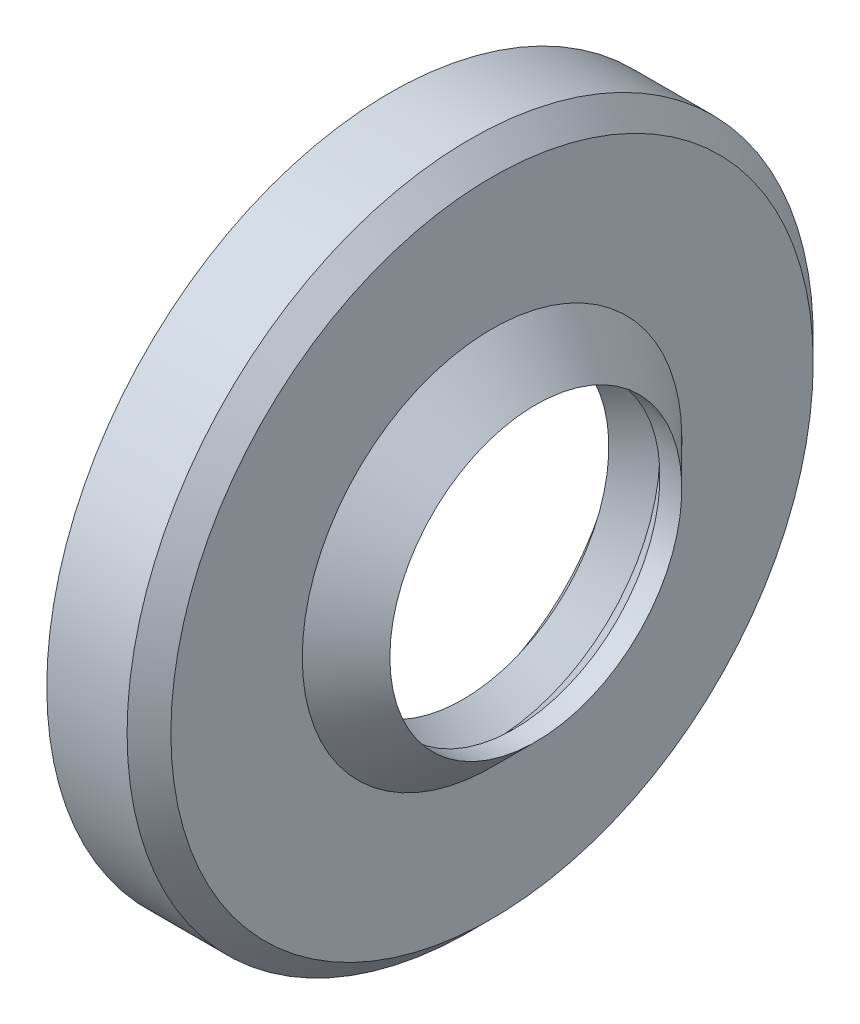
ISO-10303-21;
HEADER;
FILE_DESCRIPTION(('STEP AP214'),'2;1');
FILE_NAME('part.step','',(''),(''),'','','');
FILE_SCHEMA(('AUTOMOTIVE_DESIGN { 1 0 10303 214 1 1 1 1 }'));
ENDSEC;
DATA;
#1=APPLICATION_CONTEXT('core data for automotive mechanical design processes');
#2=APPLICATION_PROTOCOL_DEFINITION('international standard','automotive_design',2000,#1);
#3=PRODUCT_CONTEXT('',#1,'mechanical');
#4=PRODUCT('Part','Part','',(#3));
#5=PRODUCT_RELATED_PRODUCT_CATEGORY('part','',(#4));
#6=PRODUCT_DEFINITION_FORMATION('','',#4);
#7=PRODUCT_DEFINITION_CONTEXT('part definition',#1,'design');
#8=PRODUCT_DEFINITION('design','',#6,#7);
#9=PRODUCT_DEFINITION_SHAPE('','',#8);
#10=(LENGTH_UNIT() NAMED_UNIT(*) SI_UNIT(.MILLI.,.METRE.));
#11=(NAMED_UNIT(*) PLANE_ANGLE_UNIT() SI_UNIT($,.RADIAN.));
#12=(NAMED_UNIT(*) SI_UNIT($,.STERADIAN.) SOLID_ANGLE_UNIT());
#13=UNCERTAINTY_MEASURE_WITH_UNIT(LENGTH_MEASURE(1.E-05),#10,'distance_accuracy_value','');
#14=(GEOMETRIC_REPRESENTATION_CONTEXT(3) GLOBAL_UNCERTAINTY_ASSIGNED_CONTEXT((#13)) GLOBAL_UNIT_ASSIGNED_CONTEXT((#10,
#11,#12)) REPRESENTATION_CONTEXT('',''));
#15=CARTESIAN_POINT('',(0.,0.,0.));
#16=DIRECTION('',(0.,0.,1.));
#17=DIRECTION('',(1.,0.,0.));
#18=AXIS2_PLACEMENT_3D('',#15,#16,#17);
#19=CARTESIAN_POINT('',(-1000.,0.,0.));
#20=DIRECTION('',(-1.,0.,0.));
#21=DIRECTION('',(0.,0.,1.));
#22=AXIS2_PLACEMENT_3D('',#19,#20,#21);
#23=CYLINDRICAL_SURFACE('',#22,22.);
#24=CARTESIAN_POINT('',(5.50000000000006,0.,0.));
#25=DIRECTION('',(-1.,0.,0.));
#26=DIRECTION('',(0.,0.,1.));
#27=AXIS2_PLACEMENT_3D('',#24,#25,#26);
#28=CIRCLE('',#27,22.);
#29=CARTESIAN_POINT('',(5.50000000000006,0.,22.));
#30=VERTEX_POINT('',#29);
#31=EDGE_CURVE('E77',#30,#30,#28,.T.);
#32=ORIENTED_EDGE('',*,*,#31,.F.);
#33=EDGE_LOOP('',(#32));
#34=FACE_BOUND('',#33,.T.);
#35=CARTESIAN_POINT('',(0.,0.,0.));
#36=DIRECTION('',(-1.,0.,0.));
#37=DIRECTION('',(0.,0.,1.));
#38=AXIS2_PLACEMENT_3D('',#35,#36,#37);
#39=CIRCLE('',#38,22.);
#40=CARTESIAN_POINT('',(0.,0.,22.));
#41=VERTEX_POINT('',#40);
#42=EDGE_CURVE('E10',#41,#41,#39,.T.);
#43=ORIENTED_EDGE('',*,*,#42,.T.);
#44=EDGE_LOOP('',(#43));
#45=FACE_BOUND('',#44,.T.);
#46=ADVANCED_FACE('F34',(#34,#45),#23,.F.);
#47=CARTESIAN_POINT('',(0.,22.,0.));
#48=DIRECTION('',(1.,0.,0.));
#49=DIRECTION('',(0.,0.,-1.));
#50=AXIS2_PLACEMENT_3D('',#47,#48,#49);
#51=PLANE('',#50);
#52=ORIENTED_EDGE('',*,*,#42,.F.);
#53=EDGE_LOOP('',(#52));
#54=FACE_BOUND('',#53,.T.);
#55=CARTESIAN_POINT('',(0.,0.,0.));
#56=DIRECTION('',(-1.,0.,0.));
#57=DIRECTION('',(0.,0.,1.));
#58=AXIS2_PLACEMENT_3D('',#55,#56,#57);
#59=CIRCLE('',#58,23.5);
#60=CARTESIAN_POINT('',(0.,0.,23.5));
#61=VERTEX_POINT('',#60);
#62=EDGE_CURVE('E40',#61,#61,#59,.T.);
#63=ORIENTED_EDGE('',*,*,#62,.T.);
#64=EDGE_LOOP('',(#63));
#65=FACE_BOUND('',#64,.T.);
#66=ADVANCED_FACE('F84',(#54,#65),#51,.F.);
#67=CARTESIAN_POINT('',(-1000.,0.,0.));
#68=DIRECTION('',(-1.,0.,0.));
#69=DIRECTION('',(0.,0.,1.));
#70=AXIS2_PLACEMENT_3D('',#67,#68,#69);
#71=CYLINDRICAL_SURFACE('',#70,23.5);
#72=ORIENTED_EDGE('',*,*,#62,.F.);
#73=EDGE_LOOP('',(#72));
#74=FACE_BOUND('',#73,.T.);
#75=CARTESIAN_POINT('',(5.50000000000006,0.,0.));
#76=DIRECTION('',(-1.,0.,0.));
#77=DIRECTION('',(0.,0.,1.));
#78=AXIS2_PLACEMENT_3D('',#75,#76,#77);
#79=CIRCLE('',#78,23.5);
#80=CARTESIAN_POINT('',(5.50000000000006,0.,23.5));
#81=VERTEX_POINT('',#80);
#82=EDGE_CURVE('E44',#81,#81,#79,.T.);
#83=ORIENTED_EDGE('',*,*,#82,.T.);
#84=EDGE_LOOP('',(#83));
#85=FACE_BOUND('',#84,.T.);
#86=ADVANCED_FACE('F88',(#74,#85),#71,.T.);
#87=CARTESIAN_POINT('',(6.9999999999999,0.,0.));
#88=DIRECTION('',(-1.,0.,0.));
#89=DIRECTION('',(0.,0.,1.));
#90=AXIS2_PLACEMENT_3D('',#87,#88,#89);
#91=CONICAL_SURFACE('',#90,22.,0.785398163397503);
#92=ORIENTED_EDGE('',*,*,#82,.F.);
#93=EDGE_LOOP('',(#92));
#94=FACE_BOUND('',#93,.T.);
#95=CARTESIAN_POINT('',(6.9999999999999,0.,0.));
#96=DIRECTION('',(-1.,0.,0.));
#97=DIRECTION('',(0.,0.,1.));
#98=AXIS2_PLACEMENT_3D('',#95,#96,#97);
#99=CIRCLE('',#98,22.);
#100=CARTESIAN_POINT('',(6.9999999999999,0.,22.));
#101=VERTEX_POINT('',#100);
#102=EDGE_CURVE('E48',#101,#101,#99,.T.);
#103=ORIENTED_EDGE('',*,*,#102,.T.);
#104=EDGE_LOOP('',(#103));
#105=FACE_BOUND('',#104,.T.);
#106=ADVANCED_FACE('F93',(#94,#105),#91,.T.);
#107=CARTESIAN_POINT('',(7.,22.,0.));
#108=DIRECTION('',(-1.,0.,0.));
#109=DIRECTION('',(0.,0.,1.));
#110=AXIS2_PLACEMENT_3D('',#107,#108,#109);
#111=PLANE('',#110);
#112=ORIENTED_EDGE('',*,*,#102,.F.);
#113=EDGE_LOOP('',(#112));
#114=FACE_BOUND('',#113,.T.);
#115=CARTESIAN_POINT('',(6.9999999999999,0.,0.));
#116=DIRECTION('',(-1.,0.,0.));
#117=DIRECTION('',(0.,0.,1.));
#118=AXIS2_PLACEMENT_3D('',#115,#116,#117);
#119=CIRCLE('',#118,13.);
#120=CARTESIAN_POINT('',(6.9999999999999,0.,13.));
#121=VERTEX_POINT('',#120);
#122=EDGE_CURVE('E53',#121,#121,#119,.T.);
#123=ORIENTED_EDGE('',*,*,#122,.T.);
#124=EDGE_LOOP('',(#123));
#125=FACE_BOUND('',#124,.T.);
#126=ADVANCED_FACE('F99',(#114,#125),#111,.F.);
#127=CARTESIAN_POINT('',(10.,0.,0.));
#128=DIRECTION('',(-1.,0.,0.));
#129=DIRECTION('',(0.,0.,1.));
#130=AXIS2_PLACEMENT_3D('',#127,#128,#129);
#131=CONICAL_SURFACE('',#130,10.,0.785398163397428);
#132=ORIENTED_EDGE('',*,*,#122,.F.);
#133=EDGE_LOOP('',(#132));
#134=FACE_BOUND('',#133,.T.);
#135=CARTESIAN_POINT('',(10.,0.,0.));
#136=DIRECTION('',(-1.,0.,0.));
#137=DIRECTION('',(0.,0.,1.));
#138=AXIS2_PLACEMENT_3D('',#135,#136,#137);
#139=CIRCLE('',#138,10.);
#140=CARTESIAN_POINT('',(10.,0.,10.));
#141=VERTEX_POINT('',#140);
#142=EDGE_CURVE('E56',#141,#141,#139,.T.);
#143=ORIENTED_EDGE('',*,*,#142,.T.);
#144=EDGE_LOOP('',(#143));
#145=FACE_BOUND('',#144,.T.);
#146=ADVANCED_FACE('F103',(#134,#145),#131,.T.);
#147=CARTESIAN_POINT('',(-1000.,0.,0.));
#148=DIRECTION('',(-1.,0.,0.));
#149=DIRECTION('',(0.,0.,1.));
#150=AXIS2_PLACEMENT_3D('',#147,#148,#149);
#151=CYLINDRICAL_SURFACE('',#150,10.);
#152=ORIENTED_EDGE('',*,*,#142,.F.);
#153=EDGE_LOOP('',(#152));
#154=FACE_BOUND('',#153,.T.);
#155=CARTESIAN_POINT('',(8.49999999999995,0.,0.));
#156=DIRECTION('',(-1.,0.,0.));
#157=DIRECTION('',(0.,0.,1.));
#158=AXIS2_PLACEMENT_3D('',#155,#156,#157);
#159=CIRCLE('',#158,10.);
#160=CARTESIAN_POINT('',(8.49999999999995,0.,10.));
#161=VERTEX_POINT('',#160);
#162=EDGE_CURVE('E59',#161,#161,#159,.T.);
#163=ORIENTED_EDGE('',*,*,#162,.T.);
#164=EDGE_LOOP('',(#163));
#165=FACE_BOUND('',#164,.T.);
#166=ADVANCED_FACE('F107',(#154,#165),#151,.F.);
#167=CARTESIAN_POINT('',(6.9999999999999,0.,0.));
#168=DIRECTION('',(-1.,0.,0.));
#169=DIRECTION('',(0.,0.,1.));
#170=AXIS2_PLACEMENT_3D('',#167,#168,#169);
#171=CONICAL_SURFACE('',#170,11.5,0.785398163397427);
#172=ORIENTED_EDGE('',*,*,#162,.F.);
#173=EDGE_LOOP('',(#172));
#174=FACE_BOUND('',#173,.T.);
#175=CARTESIAN_POINT('',(6.9999999999999,0.,0.));
#176=DIRECTION('',(-1.,0.,0.));
#177=DIRECTION('',(0.,0.,1.));
#178=AXIS2_PLACEMENT_3D('',#175,#176,#177);
#179=CIRCLE('',#178,11.5);
#180=CARTESIAN_POINT('',(6.9999999999999,0.,11.5));
#181=VERTEX_POINT('',#180);
#182=EDGE_CURVE('E62',#181,#181,#179,.T.);
#183=ORIENTED_EDGE('',*,*,#182,.T.);
#184=EDGE_LOOP('',(#183));
#185=FACE_BOUND('',#184,.T.);
#186=ADVANCED_FACE('F111',(#174,#185),#171,.F.);
#187=CARTESIAN_POINT('',(5.00000000000012,0.,0.));
#188=DIRECTION('',(1.,0.,0.));
#189=DIRECTION('',(0.,0.,-1.));
#190=AXIS2_PLACEMENT_3D('',#187,#188,#189);
#191=CONICAL_SURFACE('',#190,10.,0.643501108793335);
#192=ORIENTED_EDGE('',*,*,#182,.F.);
#193=EDGE_LOOP('',(#192));
#194=FACE_BOUND('',#193,.T.);
#195=CARTESIAN_POINT('',(5.00000000000012,0.,0.));
#196=DIRECTION('',(-1.,0.,0.));
#197=DIRECTION('',(0.,0.,1.));
#198=AXIS2_PLACEMENT_3D('',#195,#196,#197);
#199=CIRCLE('',#198,10.);
#200=CARTESIAN_POINT('',(5.00000000000012,0.,10.));
#201=VERTEX_POINT('',#200);
#202=EDGE_CURVE('E65',#201,#201,#199,.T.);
#203=ORIENTED_EDGE('',*,*,#202,.T.);
#204=EDGE_LOOP('',(#203));
#205=FACE_BOUND('',#204,.T.);
#206=ADVANCED_FACE('F115',(#194,#205),#191,.F.);
#207=CARTESIAN_POINT('',(2.75000000000003,0.,0.));
#208=DIRECTION('',(-1.,0.,0.));
#209=DIRECTION('',(0.,0.,1.));
#210=AXIS2_PLACEMENT_3D('',#207,#208,#209);
#211=CONICAL_SURFACE('',#210,13.,0.927295218001593);
#212=ORIENTED_EDGE('',*,*,#202,.F.);
#213=EDGE_LOOP('',(#212));
#214=FACE_BOUND('',#213,.T.);
#215=CARTESIAN_POINT('',(2.75000000000003,0.,0.));
#216=DIRECTION('',(-1.,0.,0.));
#217=DIRECTION('',(0.,0.,1.));
#218=AXIS2_PLACEMENT_3D('',#215,#216,#217);
#219=CIRCLE('',#218,13.);
#220=CARTESIAN_POINT('',(2.75000000000003,0.,13.));
#221=VERTEX_POINT('',#220);
#222=EDGE_CURVE('E68',#221,#221,#219,.T.);
#223=ORIENTED_EDGE('',*,*,#222,.T.);
#224=EDGE_LOOP('',(#223));
#225=FACE_BOUND('',#224,.T.);
#226=ADVANCED_FACE('F119',(#214,#225),#211,.F.);
#227=CARTESIAN_POINT('',(2.75,13.,0.));
#228=DIRECTION('',(1.,0.,0.));
#229=DIRECTION('',(0.,0.,-1.));
#230=AXIS2_PLACEMENT_3D('',#227,#228,#229);
#231=PLANE('',#230);
#232=ORIENTED_EDGE('',*,*,#222,.F.);
#233=EDGE_LOOP('',(#232));
#234=FACE_BOUND('',#233,.T.);
#235=CARTESIAN_POINT('',(2.75000000000003,0.,0.));
#236=DIRECTION('',(-1.,0.,0.));
#237=DIRECTION('',(0.,0.,1.));
#238=AXIS2_PLACEMENT_3D('',#235,#236,#237);
#239=CIRCLE('',#238,14.5);
#240=CARTESIAN_POINT('',(2.75000000000003,0.,14.5));
#241=VERTEX_POINT('',#240);
#242=EDGE_CURVE('E71',#241,#241,#239,.T.);
#243=ORIENTED_EDGE('',*,*,#242,.T.);
#244=EDGE_LOOP('',(#243));
#245=FACE_BOUND('',#244,.T.);
#246=ADVANCED_FACE('F123',(#234,#245),#231,.F.);
#247=CARTESIAN_POINT('',(-1000.,0.,0.));
#248=DIRECTION('',(-1.,0.,0.));
#249=DIRECTION('',(0.,0.,1.));
#250=AXIS2_PLACEMENT_3D('',#247,#248,#249);
#251=CYLINDRICAL_SURFACE('',#250,14.5);
#252=ORIENTED_EDGE('',*,*,#242,.F.);
#253=EDGE_LOOP('',(#252));
#254=FACE_BOUND('',#253,.T.);
#255=CARTESIAN_POINT('',(5.50000000000006,0.,0.));
#256=DIRECTION('',(-1.,0.,0.));
#257=DIRECTION('',(0.,0.,1.));
#258=AXIS2_PLACEMENT_3D('',#255,#256,#257);
#259=CIRCLE('',#258,14.5);
#260=CARTESIAN_POINT('',(5.50000000000006,0.,14.5));
#261=VERTEX_POINT('',#260);
#262=EDGE_CURVE('E74',#261,#261,#259,.T.);
#263=ORIENTED_EDGE('',*,*,#262,.T.);
#264=EDGE_LOOP('',(#263));
#265=FACE_BOUND('',#264,.T.);
#266=ADVANCED_FACE('F127',(#254,#265),#251,.T.);
#267=CARTESIAN_POINT('',(5.5,14.5,0.));
#268=DIRECTION('',(1.,0.,0.));
#269=DIRECTION('',(0.,0.,-1.));
#270=AXIS2_PLACEMENT_3D('',#267,#268,#269);
#271=PLANE('',#270);
#272=ORIENTED_EDGE('',*,*,#262,.F.);
#273=EDGE_LOOP('',(#272));
#274=FACE_BOUND('',#273,.T.);
#275=ORIENTED_EDGE('',*,*,#31,.T.);
#276=EDGE_LOOP('',(#275));
#277=FACE_BOUND('',#276,.T.);
#278=ADVANCED_FACE('F81',(#274,#277),#271,.F.);
#279=CLOSED_SHELL('',(#46,#66,#86,#106,#126,#146,#166,#186,#206,#226,#246,#266,#278));
#280=MANIFOLD_SOLID_BREP('B2',#279);
#281=ADVANCED_BREP_SHAPE_REPRESENTATION('',(#18,#280),#14);
#282=SHAPE_DEFINITION_REPRESENTATION(#9,#281);
ENDSEC;
END-ISO-10303-21;
